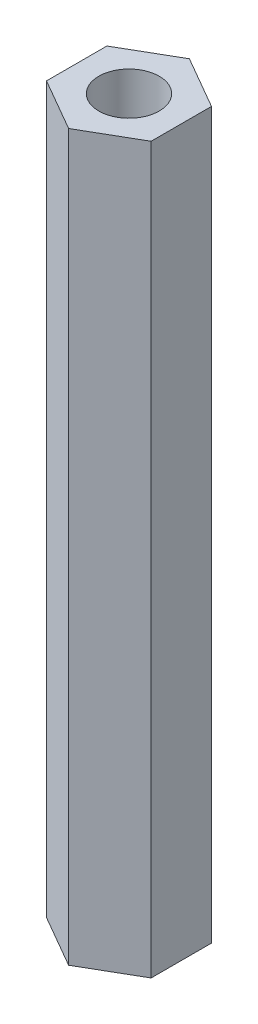
ISO-10303-21;
HEADER;
FILE_DESCRIPTION(('STEP AP214'),'2;1');
FILE_NAME('part.step','',(''),(''),'','','');
FILE_SCHEMA(('AUTOMOTIVE_DESIGN { 1 0 10303 214 1 1 1 1 }'));
ENDSEC;
DATA;
#1=APPLICATION_CONTEXT('core data for automotive mechanical design processes');
#2=APPLICATION_PROTOCOL_DEFINITION('international standard','automotive_design',2000,#1);
#3=PRODUCT_CONTEXT('',#1,'mechanical');
#4=PRODUCT('Part','Part','',(#3));
#5=PRODUCT_RELATED_PRODUCT_CATEGORY('part','',(#4));
#6=PRODUCT_DEFINITION_FORMATION('','',#4);
#7=PRODUCT_DEFINITION_CONTEXT('part definition',#1,'design');
#8=PRODUCT_DEFINITION('design','',#6,#7);
#9=PRODUCT_DEFINITION_SHAPE('','',#8);
#10=(LENGTH_UNIT() NAMED_UNIT(*) SI_UNIT(.MILLI.,.METRE.));
#11=(NAMED_UNIT(*) PLANE_ANGLE_UNIT() SI_UNIT($,.RADIAN.));
#12=(NAMED_UNIT(*) SI_UNIT($,.STERADIAN.) SOLID_ANGLE_UNIT());
#13=UNCERTAINTY_MEASURE_WITH_UNIT(LENGTH_MEASURE(1.E-05),#10,'distance_accuracy_value','');
#14=(GEOMETRIC_REPRESENTATION_CONTEXT(3) GLOBAL_UNCERTAINTY_ASSIGNED_CONTEXT((#13)) GLOBAL_UNIT_ASSIGNED_CONTEXT((#10,
#11,#12)) REPRESENTATION_CONTEXT('',''));
#15=CARTESIAN_POINT('',(0.,0.,0.));
#16=DIRECTION('',(0.,0.,1.));
#17=DIRECTION('',(1.,0.,0.));
#18=AXIS2_PLACEMENT_3D('',#15,#16,#17);
#19=CARTESIAN_POINT('',(0.,60.,-5.));
#20=DIRECTION('',(0.,1.,0.));
#21=DIRECTION('',(0.,0.,1.));
#22=AXIS2_PLACEMENT_3D('',#19,#20,#21);
#23=PLANE('',#22);
#24=DIRECTION('',(-0.866025403784439,0.,-0.5));
#25=VECTOR('',#24,1.);
#26=CARTESIAN_POINT('',(4.33012701892219,60.,-2.5));
#27=LINE('',#26,#25);
#28=CARTESIAN_POINT('',(4.33012701892219,60.,-2.5));
#29=VERTEX_POINT('',#28);
#30=CARTESIAN_POINT('',(0.,60.,-5.));
#31=VERTEX_POINT('',#30);
#32=EDGE_CURVE('E127',#29,#31,#27,.T.);
#33=ORIENTED_EDGE('',*,*,#32,.T.);
#34=DIRECTION('',(-0.866025403784439,0.,0.5));
#35=VECTOR('',#34,1.);
#36=CARTESIAN_POINT('',(0.,60.,-5.));
#37=LINE('',#36,#35);
#38=CARTESIAN_POINT('',(-4.33012701892219,60.,-2.5));
#39=VERTEX_POINT('',#38);
#40=EDGE_CURVE('E85',#31,#39,#37,.T.);
#41=ORIENTED_EDGE('',*,*,#40,.T.);
#42=DIRECTION('',(0.,0.,1.));
#43=VECTOR('',#42,1.);
#44=CARTESIAN_POINT('',(-4.33012701892219,60.,-2.5));
#45=LINE('',#44,#43);
#46=CARTESIAN_POINT('',(-4.33012701892219,60.,2.5));
#47=VERTEX_POINT('',#46);
#48=EDGE_CURVE('E98',#39,#47,#45,.T.);
#49=ORIENTED_EDGE('',*,*,#48,.T.);
#50=DIRECTION('',(0.866025403784439,0.,0.5));
#51=VECTOR('',#50,1.);
#52=CARTESIAN_POINT('',(-4.33012701892219,60.,2.5));
#53=LINE('',#52,#51);
#54=CARTESIAN_POINT('',(0.,60.,5.));
#55=VERTEX_POINT('',#54);
#56=EDGE_CURVE('E92',#47,#55,#53,.T.);
#57=ORIENTED_EDGE('',*,*,#56,.T.);
#58=DIRECTION('',(0.866025403784439,0.,-0.5));
#59=VECTOR('',#58,1.);
#60=CARTESIAN_POINT('',(0.,60.,5.));
#61=LINE('',#60,#59);
#62=CARTESIAN_POINT('',(4.33012701892219,60.,2.5));
#63=VERTEX_POINT('',#62);
#64=EDGE_CURVE('E96',#55,#63,#61,.T.);
#65=ORIENTED_EDGE('',*,*,#64,.T.);
#66=DIRECTION('',(0.,0.,-1.));
#67=VECTOR('',#66,1.);
#68=CARTESIAN_POINT('',(4.33012701892219,60.,2.5));
#69=LINE('',#68,#67);
#70=EDGE_CURVE('E48',#63,#29,#69,.T.);
#71=ORIENTED_EDGE('',*,*,#70,.T.);
#72=EDGE_LOOP('',(#33,#41,#49,#57,#65,#71));
#73=FACE_BOUND('',#72,.T.);
#74=CARTESIAN_POINT('',(0.,60.,0.));
#75=DIRECTION('',(0.,1.,0.));
#76=DIRECTION('',(0.,0.,1.));
#77=AXIS2_PLACEMENT_3D('',#74,#75,#76);
#78=CIRCLE('',#77,2.5);
#79=CARTESIAN_POINT('',(0.,60.,2.5));
#80=VERTEX_POINT('',#79);
#81=EDGE_CURVE('E120',#80,#80,#78,.T.);
#82=ORIENTED_EDGE('',*,*,#81,.F.);
#83=EDGE_LOOP('',(#82));
#84=FACE_BOUND('',#83,.T.);
#85=ADVANCED_FACE('F31',(#73,#84),#23,.T.);
#86=CARTESIAN_POINT('',(0.,0.,-5.));
#87=DIRECTION('',(0.,1.,0.));
#88=DIRECTION('',(0.,0.,1.));
#89=AXIS2_PLACEMENT_3D('',#86,#87,#88);
#90=PLANE('',#89);
#91=DIRECTION('',(-0.866025403784439,0.,-0.5));
#92=VECTOR('',#91,1.);
#93=CARTESIAN_POINT('',(4.33012701892219,0.,-2.5));
#94=LINE('',#93,#92);
#95=CARTESIAN_POINT('',(4.33012701892219,0.,-2.5));
#96=VERTEX_POINT('',#95);
#97=CARTESIAN_POINT('',(0.,0.,-5.));
#98=VERTEX_POINT('',#97);
#99=EDGE_CURVE('E116',#96,#98,#94,.T.);
#100=ORIENTED_EDGE('',*,*,#99,.F.);
#101=DIRECTION('',(0.,0.,-1.));
#102=VECTOR('',#101,1.);
#103=CARTESIAN_POINT('',(4.33012701892219,0.,2.5));
#104=LINE('',#103,#102);
#105=CARTESIAN_POINT('',(4.33012701892219,0.,2.5));
#106=VERTEX_POINT('',#105);
#107=EDGE_CURVE('E77',#106,#96,#104,.T.);
#108=ORIENTED_EDGE('',*,*,#107,.F.);
#109=DIRECTION('',(0.866025403784439,0.,-0.5));
#110=VECTOR('',#109,1.);
#111=CARTESIAN_POINT('',(0.,0.,5.));
#112=LINE('',#111,#110);
#113=CARTESIAN_POINT('',(0.,0.,5.));
#114=VERTEX_POINT('',#113);
#115=EDGE_CURVE('E71',#114,#106,#112,.T.);
#116=ORIENTED_EDGE('',*,*,#115,.F.);
#117=DIRECTION('',(0.866025403784439,0.,0.5));
#118=VECTOR('',#117,1.);
#119=CARTESIAN_POINT('',(-4.33012701892219,0.,2.5));
#120=LINE('',#119,#118);
#121=CARTESIAN_POINT('',(-4.33012701892219,0.,2.5));
#122=VERTEX_POINT('',#121);
#123=EDGE_CURVE('E106',#122,#114,#120,.T.);
#124=ORIENTED_EDGE('',*,*,#123,.F.);
#125=DIRECTION('',(0.,0.,1.));
#126=VECTOR('',#125,1.);
#127=CARTESIAN_POINT('',(-4.33012701892219,0.,-2.5));
#128=LINE('',#127,#126);
#129=CARTESIAN_POINT('',(-4.33012701892219,0.,-2.5));
#130=VERTEX_POINT('',#129);
#131=EDGE_CURVE('E122',#130,#122,#128,.T.);
#132=ORIENTED_EDGE('',*,*,#131,.F.);
#133=DIRECTION('',(-0.866025403784439,0.,0.5));
#134=VECTOR('',#133,1.);
#135=CARTESIAN_POINT('',(0.,0.,-5.));
#136=LINE('',#135,#134);
#137=EDGE_CURVE('E119',#98,#130,#136,.T.);
#138=ORIENTED_EDGE('',*,*,#137,.F.);
#139=EDGE_LOOP('',(#100,#108,#116,#124,#132,#138));
#140=FACE_BOUND('',#139,.T.);
#141=CARTESIAN_POINT('',(0.,0.,0.));
#142=DIRECTION('',(0.,1.,0.));
#143=DIRECTION('',(0.,0.,1.));
#144=AXIS2_PLACEMENT_3D('',#141,#142,#143);
#145=CIRCLE('',#144,2.5);
#146=CARTESIAN_POINT('',(0.,0.,2.5));
#147=VERTEX_POINT('',#146);
#148=EDGE_CURVE('E220',#147,#147,#145,.T.);
#149=ORIENTED_EDGE('',*,*,#148,.T.);
#150=EDGE_LOOP('',(#149));
#151=FACE_BOUND('',#150,.T.);
#152=ADVANCED_FACE('F136',(#140,#151),#90,.F.);
#153=CARTESIAN_POINT('',(4.33012701892219,60.,-2.5));
#154=DIRECTION('',(-0.5,0.,0.866025403784439));
#155=DIRECTION('',(0.866025403784439,0.,0.5));
#156=AXIS2_PLACEMENT_3D('',#153,#154,#155);
#157=PLANE('',#156);
#158=ORIENTED_EDGE('',*,*,#99,.T.);
#159=DIRECTION('',(0.,-1.,0.));
#160=VECTOR('',#159,1.);
#161=CARTESIAN_POINT('',(0.,60.,-5.));
#162=LINE('',#161,#160);
#163=EDGE_CURVE('E11',#31,#98,#162,.T.);
#164=ORIENTED_EDGE('',*,*,#163,.F.);
#165=ORIENTED_EDGE('',*,*,#32,.F.);
#166=DIRECTION('',(0.,-1.,0.));
#167=VECTOR('',#166,1.);
#168=CARTESIAN_POINT('',(4.33012701892219,60.,-2.5));
#169=LINE('',#168,#167);
#170=EDGE_CURVE('E112',#29,#96,#169,.T.);
#171=ORIENTED_EDGE('',*,*,#170,.T.);
#172=EDGE_LOOP('',(#158,#164,#165,#171));
#173=FACE_BOUND('',#172,.T.);
#174=ADVANCED_FACE('F33',(#173),#157,.F.);
#175=CARTESIAN_POINT('',(0.,60.,-5.));
#176=DIRECTION('',(0.5,0.,0.866025403784439));
#177=DIRECTION('',(0.866025403784439,0.,-0.5));
#178=AXIS2_PLACEMENT_3D('',#175,#176,#177);
#179=PLANE('',#178);
#180=ORIENTED_EDGE('',*,*,#137,.T.);
#181=DIRECTION('',(0.,-1.,0.));
#182=VECTOR('',#181,1.);
#183=CARTESIAN_POINT('',(-4.33012701892219,60.,-2.5));
#184=LINE('',#183,#182);
#185=EDGE_CURVE('E40',#39,#130,#184,.T.);
#186=ORIENTED_EDGE('',*,*,#185,.F.);
#187=ORIENTED_EDGE('',*,*,#40,.F.);
#188=ORIENTED_EDGE('',*,*,#163,.T.);
#189=EDGE_LOOP('',(#180,#186,#187,#188));
#190=FACE_BOUND('',#189,.T.);
#191=ADVANCED_FACE('F161',(#190),#179,.F.);
#192=CARTESIAN_POINT('',(-4.33012701892219,60.,-2.5));
#193=DIRECTION('',(1.,0.,0.));
#194=DIRECTION('',(0.,0.,-1.));
#195=AXIS2_PLACEMENT_3D('',#192,#193,#194);
#196=PLANE('',#195);
#197=ORIENTED_EDGE('',*,*,#131,.T.);
#198=DIRECTION('',(0.,-1.,0.));
#199=VECTOR('',#198,1.);
#200=CARTESIAN_POINT('',(-4.33012701892219,60.,2.5));
#201=LINE('',#200,#199);
#202=EDGE_CURVE('E107',#47,#122,#201,.T.);
#203=ORIENTED_EDGE('',*,*,#202,.F.);
#204=ORIENTED_EDGE('',*,*,#48,.F.);
#205=ORIENTED_EDGE('',*,*,#185,.T.);
#206=EDGE_LOOP('',(#197,#203,#204,#205));
#207=FACE_BOUND('',#206,.T.);
#208=ADVANCED_FACE('F133',(#207),#196,.F.);
#209=CARTESIAN_POINT('',(-4.33012701892219,60.,2.5));
#210=DIRECTION('',(0.5,0.,-0.866025403784439));
#211=DIRECTION('',(-0.866025403784439,0.,-0.5));
#212=AXIS2_PLACEMENT_3D('',#209,#210,#211);
#213=PLANE('',#212);
#214=ORIENTED_EDGE('',*,*,#123,.T.);
#215=DIRECTION('',(0.,-1.,0.));
#216=VECTOR('',#215,1.);
#217=CARTESIAN_POINT('',(0.,60.,5.));
#218=LINE('',#217,#216);
#219=EDGE_CURVE('E103',#55,#114,#218,.T.);
#220=ORIENTED_EDGE('',*,*,#219,.F.);
#221=ORIENTED_EDGE('',*,*,#56,.F.);
#222=ORIENTED_EDGE('',*,*,#202,.T.);
#223=EDGE_LOOP('',(#214,#220,#221,#222));
#224=FACE_BOUND('',#223,.T.);
#225=ADVANCED_FACE('F104',(#224),#213,.F.);
#226=CARTESIAN_POINT('',(0.,60.,5.));
#227=DIRECTION('',(-0.5,0.,-0.866025403784439));
#228=DIRECTION('',(-0.866025403784439,0.,0.5));
#229=AXIS2_PLACEMENT_3D('',#226,#227,#228);
#230=PLANE('',#229);
#231=ORIENTED_EDGE('',*,*,#115,.T.);
#232=DIRECTION('',(0.,-1.,0.));
#233=VECTOR('',#232,1.);
#234=CARTESIAN_POINT('',(4.33012701892219,60.,2.5));
#235=LINE('',#234,#233);
#236=EDGE_CURVE('E108',#63,#106,#235,.T.);
#237=ORIENTED_EDGE('',*,*,#236,.F.);
#238=ORIENTED_EDGE('',*,*,#64,.F.);
#239=ORIENTED_EDGE('',*,*,#219,.T.);
#240=EDGE_LOOP('',(#231,#237,#238,#239));
#241=FACE_BOUND('',#240,.T.);
#242=ADVANCED_FACE('F110',(#241),#230,.F.);
#243=CARTESIAN_POINT('',(4.33012701892219,60.,2.5));
#244=DIRECTION('',(-1.,0.,0.));
#245=DIRECTION('',(0.,0.,1.));
#246=AXIS2_PLACEMENT_3D('',#243,#244,#245);
#247=PLANE('',#246);
#248=ORIENTED_EDGE('',*,*,#107,.T.);
#249=ORIENTED_EDGE('',*,*,#170,.F.);
#250=ORIENTED_EDGE('',*,*,#70,.F.);
#251=ORIENTED_EDGE('',*,*,#236,.T.);
#252=EDGE_LOOP('',(#248,#249,#250,#251));
#253=FACE_BOUND('',#252,.T.);
#254=ADVANCED_FACE('F141',(#253),#247,.F.);
#255=CARTESIAN_POINT('',(0.,60.,0.));
#256=DIRECTION('',(0.,-1.,0.));
#257=DIRECTION('',(0.,0.,-1.));
#258=AXIS2_PLACEMENT_3D('',#255,#256,#257);
#259=CYLINDRICAL_SURFACE('',#258,2.5);
#260=ORIENTED_EDGE('',*,*,#81,.T.);
#261=EDGE_LOOP('',(#260));
#262=FACE_BOUND('',#261,.T.);
#263=ORIENTED_EDGE('',*,*,#148,.F.);
#264=EDGE_LOOP('',(#263));
#265=FACE_BOUND('',#264,.T.);
#266=ADVANCED_FACE('F143',(#262,#265),#259,.F.);
#267=CLOSED_SHELL('',(#85,#152,#174,#191,#208,#225,#242,#254,#266));
#268=MANIFOLD_SOLID_BREP('B2',#267);
#269=ADVANCED_BREP_SHAPE_REPRESENTATION('',(#18,#268),#14);
#270=SHAPE_DEFINITION_REPRESENTATION(#9,#269);
ENDSEC;
END-ISO-10303-21;
